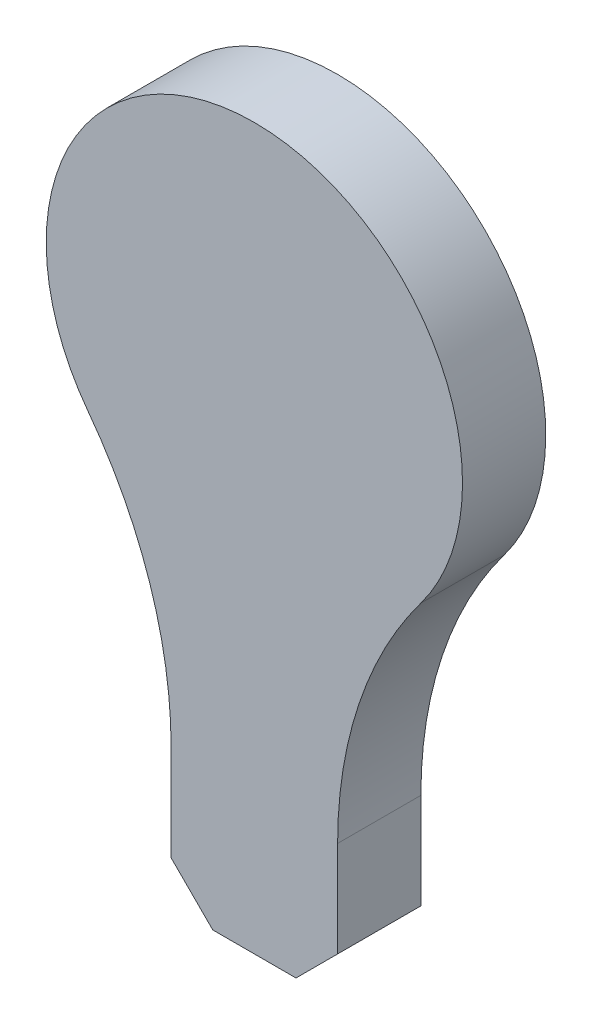
ISO-10303-21;
HEADER;
FILE_DESCRIPTION(('STEP AP214'),'2;1');
FILE_NAME('part.step','',(''),(''),'','','');
FILE_SCHEMA(('AUTOMOTIVE_DESIGN { 1 0 10303 214 1 1 1 1 }'));
ENDSEC;
DATA;
#1=APPLICATION_CONTEXT('core data for automotive mechanical design processes');
#2=APPLICATION_PROTOCOL_DEFINITION('international standard','automotive_design',2000,#1);
#3=PRODUCT_CONTEXT('',#1,'mechanical');
#4=PRODUCT('Part','Part','',(#3));
#5=PRODUCT_RELATED_PRODUCT_CATEGORY('part','',(#4));
#6=PRODUCT_DEFINITION_FORMATION('','',#4);
#7=PRODUCT_DEFINITION_CONTEXT('part definition',#1,'design');
#8=PRODUCT_DEFINITION('design','',#6,#7);
#9=PRODUCT_DEFINITION_SHAPE('','',#8);
#10=(LENGTH_UNIT() NAMED_UNIT(*) SI_UNIT(.MILLI.,.METRE.));
#11=(NAMED_UNIT(*) PLANE_ANGLE_UNIT() SI_UNIT($,.RADIAN.));
#12=(NAMED_UNIT(*) SI_UNIT($,.STERADIAN.) SOLID_ANGLE_UNIT());
#13=UNCERTAINTY_MEASURE_WITH_UNIT(LENGTH_MEASURE(1.E-05),#10,'distance_accuracy_value','');
#14=(GEOMETRIC_REPRESENTATION_CONTEXT(3) GLOBAL_UNCERTAINTY_ASSIGNED_CONTEXT((#13)) GLOBAL_UNIT_ASSIGNED_CONTEXT((#10,
#11,#12)) REPRESENTATION_CONTEXT('',''));
#15=CARTESIAN_POINT('',(0.,0.,0.));
#16=DIRECTION('',(0.,0.,1.));
#17=DIRECTION('',(1.,0.,0.));
#18=AXIS2_PLACEMENT_3D('',#15,#16,#17);
#19=CARTESIAN_POINT('',(-12.,-9.,4.6));
#20=DIRECTION('',(0.,0.,-1.));
#21=DIRECTION('',(-1.,0.,0.));
#22=AXIS2_PLACEMENT_3D('',#19,#20,#21);
#23=CYLINDRICAL_SURFACE('',#22,10.);
#24=CARTESIAN_POINT('',(-12.,-9.,2.6));
#25=DIRECTION('',(0.,0.,-1.));
#26=DIRECTION('',(1.,0.,0.));
#27=AXIS2_PLACEMENT_3D('',#24,#25,#26);
#28=CIRCLE('',#27,10.);
#29=CARTESIAN_POINT('',(-4.,-3.,2.6));
#30=VERTEX_POINT('',#29);
#31=CARTESIAN_POINT('',(-2.,-9.,2.6));
#32=VERTEX_POINT('',#31);
#33=EDGE_CURVE('E133',#30,#32,#28,.T.);
#34=ORIENTED_EDGE('',*,*,#33,.T.);
#35=DIRECTION('',(0.,0.,-1.));
#36=VECTOR('',#35,1.);
#37=CARTESIAN_POINT('',(-2.,-9.,4.6));
#38=LINE('',#37,#36);
#39=CARTESIAN_POINT('',(-2.,-9.,4.6));
#40=VERTEX_POINT('',#39);
#41=EDGE_CURVE('E11',#40,#32,#38,.T.);
#42=ORIENTED_EDGE('',*,*,#41,.F.);
#43=CARTESIAN_POINT('',(-12.,-9.,4.6));
#44=DIRECTION('',(0.,0.,-1.));
#45=DIRECTION('',(1.,0.,0.));
#46=AXIS2_PLACEMENT_3D('',#43,#44,#45);
#47=CIRCLE('',#46,10.);
#48=CARTESIAN_POINT('',(-4.,-3.,4.6));
#49=VERTEX_POINT('',#48);
#50=EDGE_CURVE('E147',#49,#40,#47,.T.);
#51=ORIENTED_EDGE('',*,*,#50,.F.);
#52=DIRECTION('',(0.,0.,-1.));
#53=VECTOR('',#52,1.);
#54=CARTESIAN_POINT('',(-4.,-3.,4.6));
#55=LINE('',#54,#53);
#56=EDGE_CURVE('E129',#49,#30,#55,.T.);
#57=ORIENTED_EDGE('',*,*,#56,.T.);
#58=EDGE_LOOP('',(#34,#42,#51,#57));
#59=FACE_BOUND('',#58,.T.);
#60=ADVANCED_FACE('F37',(#59),#23,.F.);
#61=CARTESIAN_POINT('',(-2.,-9.,4.6));
#62=DIRECTION('',(1.,0.,0.));
#63=DIRECTION('',(0.,0.,-1.));
#64=AXIS2_PLACEMENT_3D('',#61,#62,#63);
#65=PLANE('',#64);
#66=DIRECTION('',(0.,-1.,0.));
#67=VECTOR('',#66,1.);
#68=CARTESIAN_POINT('',(-2.,-9.,2.6));
#69=LINE('',#68,#67);
#70=CARTESIAN_POINT('',(-2.,-11.3,2.6));
#71=VERTEX_POINT('',#70);
#72=EDGE_CURVE('E136',#32,#71,#69,.T.);
#73=ORIENTED_EDGE('',*,*,#72,.T.);
#74=DIRECTION('',(0.,0.,-1.));
#75=VECTOR('',#74,1.);
#76=CARTESIAN_POINT('',(-2.,-11.3,4.6));
#77=LINE('',#76,#75);
#78=CARTESIAN_POINT('',(-2.,-11.3,4.6));
#79=VERTEX_POINT('',#78);
#80=EDGE_CURVE('E45',#79,#71,#77,.T.);
#81=ORIENTED_EDGE('',*,*,#80,.F.);
#82=DIRECTION('',(0.,-1.,0.));
#83=VECTOR('',#82,1.);
#84=CARTESIAN_POINT('',(-2.,-9.,4.6));
#85=LINE('',#84,#83);
#86=EDGE_CURVE('E96',#40,#79,#85,.T.);
#87=ORIENTED_EDGE('',*,*,#86,.F.);
#88=ORIENTED_EDGE('',*,*,#41,.T.);
#89=EDGE_LOOP('',(#73,#81,#87,#88));
#90=FACE_BOUND('',#89,.T.);
#91=ADVANCED_FACE('F182',(#90),#65,.F.);
#92=CARTESIAN_POINT('',(-2.,-11.3,4.6));
#93=DIRECTION('',(0.707106781186547,0.707106781186548,0.));
#94=DIRECTION('',(-0.707106781186548,0.707106781186547,0.));
#95=AXIS2_PLACEMENT_3D('',#92,#93,#94);
#96=PLANE('',#95);
#97=DIRECTION('',(0.707106781186548,-0.707106781186547,0.));
#98=VECTOR('',#97,1.);
#99=CARTESIAN_POINT('',(-2.,-11.3,2.6));
#100=LINE('',#99,#98);
#101=CARTESIAN_POINT('',(-1.,-12.3,2.6));
#102=VERTEX_POINT('',#101);
#103=EDGE_CURVE('E138',#71,#102,#100,.T.);
#104=ORIENTED_EDGE('',*,*,#103,.T.);
#105=DIRECTION('',(0.,0.,-1.));
#106=VECTOR('',#105,1.);
#107=CARTESIAN_POINT('',(-1.,-12.3,4.6));
#108=LINE('',#107,#106);
#109=CARTESIAN_POINT('',(-1.,-12.3,4.6));
#110=VERTEX_POINT('',#109);
#111=EDGE_CURVE('E154',#110,#102,#108,.T.);
#112=ORIENTED_EDGE('',*,*,#111,.F.);
#113=DIRECTION('',(0.707106781186548,-0.707106781186547,0.));
#114=VECTOR('',#113,1.);
#115=CARTESIAN_POINT('',(-2.,-11.3,4.6));
#116=LINE('',#115,#114);
#117=EDGE_CURVE('E162',#79,#110,#116,.T.);
#118=ORIENTED_EDGE('',*,*,#117,.F.);
#119=ORIENTED_EDGE('',*,*,#80,.T.);
#120=EDGE_LOOP('',(#104,#112,#118,#119));
#121=FACE_BOUND('',#120,.T.);
#122=ADVANCED_FACE('F160',(#121),#96,.F.);
#123=CARTESIAN_POINT('',(-1.,-12.3,4.6));
#124=DIRECTION('',(0.,1.,0.));
#125=DIRECTION('',(0.,0.,1.));
#126=AXIS2_PLACEMENT_3D('',#123,#124,#125);
#127=PLANE('',#126);
#128=DIRECTION('',(1.,0.,0.));
#129=VECTOR('',#128,1.);
#130=CARTESIAN_POINT('',(-1.,-12.3,2.6));
#131=LINE('',#130,#129);
#132=CARTESIAN_POINT('',(1.,-12.3,2.6));
#133=VERTEX_POINT('',#132);
#134=EDGE_CURVE('E140',#102,#133,#131,.T.);
#135=ORIENTED_EDGE('',*,*,#134,.T.);
#136=DIRECTION('',(0.,0.,-1.));
#137=VECTOR('',#136,1.);
#138=CARTESIAN_POINT('',(1.,-12.3,4.6));
#139=LINE('',#138,#137);
#140=CARTESIAN_POINT('',(1.,-12.3,4.6));
#141=VERTEX_POINT('',#140);
#142=EDGE_CURVE('E151',#141,#133,#139,.T.);
#143=ORIENTED_EDGE('',*,*,#142,.F.);
#144=DIRECTION('',(1.,0.,0.));
#145=VECTOR('',#144,1.);
#146=CARTESIAN_POINT('',(-1.,-12.3,4.6));
#147=LINE('',#146,#145);
#148=EDGE_CURVE('E174',#110,#141,#147,.T.);
#149=ORIENTED_EDGE('',*,*,#148,.F.);
#150=ORIENTED_EDGE('',*,*,#111,.T.);
#151=EDGE_LOOP('',(#135,#143,#149,#150));
#152=FACE_BOUND('',#151,.T.);
#153=ADVANCED_FACE('F170',(#152),#127,.F.);
#154=CARTESIAN_POINT('',(2.,-11.3,4.6));
#155=DIRECTION('',(-0.707106781186547,0.707106781186548,0.));
#156=DIRECTION('',(-0.707106781186548,-0.707106781186547,0.));
#157=AXIS2_PLACEMENT_3D('',#154,#155,#156);
#158=PLANE('',#157);
#159=DIRECTION('',(0.707106781186548,0.707106781186547,0.));
#160=VECTOR('',#159,1.);
#161=CARTESIAN_POINT('',(2.,-11.3,2.6));
#162=LINE('',#161,#160);
#163=CARTESIAN_POINT('',(2.,-11.3,2.6));
#164=VERTEX_POINT('',#163);
#165=EDGE_CURVE('E142',#133,#164,#162,.T.);
#166=ORIENTED_EDGE('',*,*,#165,.T.);
#167=DIRECTION('',(0.,0.,-1.));
#168=VECTOR('',#167,1.);
#169=CARTESIAN_POINT('',(2.,-11.3,4.6));
#170=LINE('',#169,#168);
#171=CARTESIAN_POINT('',(2.,-11.3,4.6));
#172=VERTEX_POINT('',#171);
#173=EDGE_CURVE('E124',#172,#164,#170,.T.);
#174=ORIENTED_EDGE('',*,*,#173,.F.);
#175=DIRECTION('',(0.707106781186548,0.707106781186547,0.));
#176=VECTOR('',#175,1.);
#177=CARTESIAN_POINT('',(2.,-11.3,4.6));
#178=LINE('',#177,#176);
#179=EDGE_CURVE('E115',#141,#172,#178,.T.);
#180=ORIENTED_EDGE('',*,*,#179,.F.);
#181=ORIENTED_EDGE('',*,*,#142,.T.);
#182=EDGE_LOOP('',(#166,#174,#180,#181));
#183=FACE_BOUND('',#182,.T.);
#184=ADVANCED_FACE('F173',(#183),#158,.F.);
#185=CARTESIAN_POINT('',(2.,-9.,4.6));
#186=DIRECTION('',(-1.,0.,0.));
#187=DIRECTION('',(0.,0.,1.));
#188=AXIS2_PLACEMENT_3D('',#185,#186,#187);
#189=PLANE('',#188);
#190=DIRECTION('',(0.,1.,0.));
#191=VECTOR('',#190,1.);
#192=CARTESIAN_POINT('',(2.,-9.,2.6));
#193=LINE('',#192,#191);
#194=CARTESIAN_POINT('',(2.,-9.,2.6));
#195=VERTEX_POINT('',#194);
#196=EDGE_CURVE('E123',#164,#195,#193,.T.);
#197=ORIENTED_EDGE('',*,*,#196,.T.);
#198=DIRECTION('',(0.,0.,-1.));
#199=VECTOR('',#198,1.);
#200=CARTESIAN_POINT('',(2.,-9.,4.6));
#201=LINE('',#200,#199);
#202=CARTESIAN_POINT('',(2.,-9.,4.6));
#203=VERTEX_POINT('',#202);
#204=EDGE_CURVE('E120',#203,#195,#201,.T.);
#205=ORIENTED_EDGE('',*,*,#204,.F.);
#206=DIRECTION('',(0.,1.,0.));
#207=VECTOR('',#206,1.);
#208=CARTESIAN_POINT('',(2.,-9.,4.6));
#209=LINE('',#208,#207);
#210=EDGE_CURVE('E109',#172,#203,#209,.T.);
#211=ORIENTED_EDGE('',*,*,#210,.F.);
#212=ORIENTED_EDGE('',*,*,#173,.T.);
#213=EDGE_LOOP('',(#197,#205,#211,#212));
#214=FACE_BOUND('',#213,.T.);
#215=ADVANCED_FACE('F121',(#214),#189,.F.);
#216=CARTESIAN_POINT('',(12.,-9.,4.6));
#217=DIRECTION('',(0.,0.,-1.));
#218=DIRECTION('',(-1.,0.,0.));
#219=AXIS2_PLACEMENT_3D('',#216,#217,#218);
#220=CYLINDRICAL_SURFACE('',#219,10.);
#221=CARTESIAN_POINT('',(12.,-9.,2.6));
#222=DIRECTION('',(0.,0.,-1.));
#223=DIRECTION('',(1.,0.,0.));
#224=AXIS2_PLACEMENT_3D('',#221,#222,#223);
#225=CIRCLE('',#224,10.);
#226=CARTESIAN_POINT('',(4.,-3.,2.6));
#227=VERTEX_POINT('',#226);
#228=EDGE_CURVE('E82',#195,#227,#225,.T.);
#229=ORIENTED_EDGE('',*,*,#228,.T.);
#230=DIRECTION('',(0.,0.,-1.));
#231=VECTOR('',#230,1.);
#232=CARTESIAN_POINT('',(4.,-3.,4.6));
#233=LINE('',#232,#231);
#234=CARTESIAN_POINT('',(4.,-3.,4.6));
#235=VERTEX_POINT('',#234);
#236=EDGE_CURVE('E125',#235,#227,#233,.T.);
#237=ORIENTED_EDGE('',*,*,#236,.F.);
#238=CARTESIAN_POINT('',(12.,-9.,4.6));
#239=DIRECTION('',(0.,0.,-1.));
#240=DIRECTION('',(1.,0.,0.));
#241=AXIS2_PLACEMENT_3D('',#238,#239,#240);
#242=CIRCLE('',#241,10.);
#243=EDGE_CURVE('E113',#203,#235,#242,.T.);
#244=ORIENTED_EDGE('',*,*,#243,.F.);
#245=ORIENTED_EDGE('',*,*,#204,.T.);
#246=EDGE_LOOP('',(#229,#237,#244,#245));
#247=FACE_BOUND('',#246,.T.);
#248=ADVANCED_FACE('F127',(#247),#220,.F.);
#249=CARTESIAN_POINT('',(0.,0.,4.6));
#250=DIRECTION('',(0.,0.,-1.));
#251=DIRECTION('',(-1.,0.,0.));
#252=AXIS2_PLACEMENT_3D('',#249,#250,#251);
#253=CYLINDRICAL_SURFACE('',#252,5.);
#254=CARTESIAN_POINT('',(0.,0.,2.6));
#255=DIRECTION('',(0.,0.,1.));
#256=DIRECTION('',(1.,0.,0.));
#257=AXIS2_PLACEMENT_3D('',#254,#255,#256);
#258=CIRCLE('',#257,5.);
#259=EDGE_CURVE('E88',#227,#30,#258,.T.);
#260=ORIENTED_EDGE('',*,*,#259,.T.);
#261=ORIENTED_EDGE('',*,*,#56,.F.);
#262=CARTESIAN_POINT('',(0.,0.,4.6));
#263=DIRECTION('',(0.,0.,1.));
#264=DIRECTION('',(1.,0.,0.));
#265=AXIS2_PLACEMENT_3D('',#262,#263,#264);
#266=CIRCLE('',#265,5.);
#267=EDGE_CURVE('E53',#235,#49,#266,.T.);
#268=ORIENTED_EDGE('',*,*,#267,.F.);
#269=ORIENTED_EDGE('',*,*,#236,.T.);
#270=EDGE_LOOP('',(#260,#261,#268,#269));
#271=FACE_BOUND('',#270,.T.);
#272=ADVANCED_FACE('F198',(#271),#253,.T.);
#273=CARTESIAN_POINT('',(-12.,-9.,4.6));
#274=DIRECTION('',(0.,0.,1.));
#275=DIRECTION('',(1.,0.,0.));
#276=AXIS2_PLACEMENT_3D('',#273,#274,#275);
#277=PLANE('',#276);
#278=ORIENTED_EDGE('',*,*,#50,.T.);
#279=ORIENTED_EDGE('',*,*,#86,.T.);
#280=ORIENTED_EDGE('',*,*,#117,.T.);
#281=ORIENTED_EDGE('',*,*,#148,.T.);
#282=ORIENTED_EDGE('',*,*,#179,.T.);
#283=ORIENTED_EDGE('',*,*,#210,.T.);
#284=ORIENTED_EDGE('',*,*,#243,.T.);
#285=ORIENTED_EDGE('',*,*,#267,.T.);
#286=EDGE_LOOP('',(#278,#279,#280,#281,#282,#283,#284,#285));
#287=FACE_BOUND('',#286,.T.);
#288=ADVANCED_FACE('F111',(#287),#277,.T.);
#289=CARTESIAN_POINT('',(-12.,-9.,2.6));
#290=DIRECTION('',(0.,0.,1.));
#291=DIRECTION('',(1.,0.,0.));
#292=AXIS2_PLACEMENT_3D('',#289,#290,#291);
#293=PLANE('',#292);
#294=ORIENTED_EDGE('',*,*,#33,.F.);
#295=ORIENTED_EDGE('',*,*,#259,.F.);
#296=ORIENTED_EDGE('',*,*,#228,.F.);
#297=ORIENTED_EDGE('',*,*,#196,.F.);
#298=ORIENTED_EDGE('',*,*,#165,.F.);
#299=ORIENTED_EDGE('',*,*,#134,.F.);
#300=ORIENTED_EDGE('',*,*,#103,.F.);
#301=ORIENTED_EDGE('',*,*,#72,.F.);
#302=EDGE_LOOP('',(#294,#295,#296,#297,#298,#299,#300,#301));
#303=FACE_BOUND('',#302,.T.);
#304=ADVANCED_FACE('F166',(#303),#293,.F.);
#305=CLOSED_SHELL('',(#60,#91,#122,#153,#184,#215,#248,#272,#288,#304));
#306=MANIFOLD_SOLID_BREP('B2',#305);
#307=ADVANCED_BREP_SHAPE_REPRESENTATION('',(#18,#306),#14);
#308=SHAPE_DEFINITION_REPRESENTATION(#9,#307);
ENDSEC;
END-ISO-10303-21;
